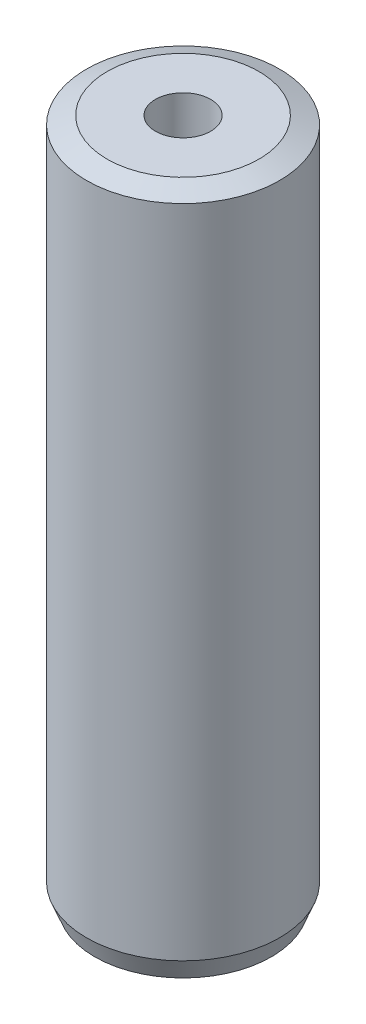
ISO-10303-21;
HEADER;
FILE_DESCRIPTION(('STEP AP214'),'2;1');
FILE_NAME('part.step','',(''),(''),'','','');
FILE_SCHEMA(('AUTOMOTIVE_DESIGN { 1 0 10303 214 1 1 1 1 }'));
ENDSEC;
DATA;
#1=APPLICATION_CONTEXT('core data for automotive mechanical design processes');
#2=APPLICATION_PROTOCOL_DEFINITION('international standard','automotive_design',2000,#1);
#3=PRODUCT_CONTEXT('',#1,'mechanical');
#4=PRODUCT('Part','Part','',(#3));
#5=PRODUCT_RELATED_PRODUCT_CATEGORY('part','',(#4));
#6=PRODUCT_DEFINITION_FORMATION('','',#4);
#7=PRODUCT_DEFINITION_CONTEXT('part definition',#1,'design');
#8=PRODUCT_DEFINITION('design','',#6,#7);
#9=PRODUCT_DEFINITION_SHAPE('','',#8);
#10=(LENGTH_UNIT() NAMED_UNIT(*) SI_UNIT(.MILLI.,.METRE.));
#11=(NAMED_UNIT(*) PLANE_ANGLE_UNIT() SI_UNIT($,.RADIAN.));
#12=(NAMED_UNIT(*) SI_UNIT($,.STERADIAN.) SOLID_ANGLE_UNIT());
#13=UNCERTAINTY_MEASURE_WITH_UNIT(LENGTH_MEASURE(1.E-05),#10,'distance_accuracy_value','');
#14=(GEOMETRIC_REPRESENTATION_CONTEXT(3) GLOBAL_UNCERTAINTY_ASSIGNED_CONTEXT((#13)) GLOBAL_UNIT_ASSIGNED_CONTEXT((#10,
#11,#12)) REPRESENTATION_CONTEXT('',''));
#15=CARTESIAN_POINT('',(0.,0.,0.));
#16=DIRECTION('',(0.,0.,1.));
#17=DIRECTION('',(1.,0.,0.));
#18=AXIS2_PLACEMENT_3D('',#15,#16,#17);
#19=CARTESIAN_POINT('',(0.,159.526723797975,0.));
#20=DIRECTION('',(0.,-1.,0.));
#21=DIRECTION('',(0.,0.,-1.));
#22=AXIS2_PLACEMENT_3D('',#19,#20,#21);
#23=CYLINDRICAL_SURFACE('',#22,22.5);
#24=CARTESIAN_POINT('',(0.,157.619761651747,0.));
#25=DIRECTION('',(0.,1.,0.));
#26=DIRECTION('',(0.,0.,1.));
#27=AXIS2_PLACEMENT_3D('',#24,#25,#26);
#28=CIRCLE('',#27,22.5);
#29=CARTESIAN_POINT('',(0.,157.619761651747,22.5));
#30=VERTEX_POINT('',#29);
#31=EDGE_CURVE('E50',#30,#30,#28,.F.);
#32=ORIENTED_EDGE('',*,*,#31,.T.);
#33=EDGE_LOOP('',(#32));
#34=FACE_BOUND('',#33,.T.);
#35=CARTESIAN_POINT('',(0.,4.80282805095927,0.));
#36=DIRECTION('',(0.,1.,0.));
#37=DIRECTION('',(0.,0.,1.));
#38=AXIS2_PLACEMENT_3D('',#35,#36,#37);
#39=CIRCLE('',#38,22.5);
#40=CARTESIAN_POINT('',(0.,4.80282805095927,22.5));
#41=VERTEX_POINT('',#40);
#42=EDGE_CURVE('E51',#41,#41,#39,.T.);
#43=ORIENTED_EDGE('',*,*,#42,.T.);
#44=EDGE_LOOP('',(#43));
#45=FACE_BOUND('',#44,.T.);
#46=ADVANCED_FACE('F39',(#34,#45),#23,.T.);
#47=CARTESIAN_POINT('',(0.,159.526723797975,0.));
#48=DIRECTION('',(0.,1.,0.));
#49=DIRECTION('',(0.,0.,1.));
#50=AXIS2_PLACEMENT_3D('',#47,#48,#49);
#51=PLANE('',#50);
#52=CARTESIAN_POINT('',(0.,159.526723797975,0.));
#53=DIRECTION('',(0.,1.,0.));
#54=DIRECTION('',(0.,0.,1.));
#55=AXIS2_PLACEMENT_3D('',#52,#53,#54);
#56=CIRCLE('',#55,17.6971719490409);
#57=CARTESIAN_POINT('',(0.,159.526723797975,17.6971719490409));
#58=VERTEX_POINT('',#57);
#59=EDGE_CURVE('E54',#58,#58,#56,.T.);
#60=ORIENTED_EDGE('',*,*,#59,.T.);
#61=EDGE_LOOP('',(#60));
#62=FACE_BOUND('',#61,.T.);
#63=CARTESIAN_POINT('',(0.,159.526723797975,0.));
#64=DIRECTION('',(0.,1.,0.));
#65=DIRECTION('',(0.,0.,1.));
#66=AXIS2_PLACEMENT_3D('',#63,#64,#65);
#67=CIRCLE('',#66,6.44107254682785);
#68=CARTESIAN_POINT('',(0.,159.526723797975,6.44107254682785));
#69=VERTEX_POINT('',#68);
#70=EDGE_CURVE('E58',#69,#69,#67,.T.);
#71=ORIENTED_EDGE('',*,*,#70,.F.);
#72=EDGE_LOOP('',(#71));
#73=FACE_BOUND('',#72,.T.);
#74=ADVANCED_FACE('F69',(#62,#73),#51,.T.);
#75=CARTESIAN_POINT('',(0.,0.,0.));
#76=DIRECTION('',(0.,1.,0.));
#77=DIRECTION('',(0.,0.,1.));
#78=AXIS2_PLACEMENT_3D('',#75,#76,#77);
#79=PLANE('',#78);
#80=CARTESIAN_POINT('',(0.,0.,0.));
#81=DIRECTION('',(0.,1.,0.));
#82=DIRECTION('',(0.,0.,1.));
#83=AXIS2_PLACEMENT_3D('',#80,#81,#82);
#84=CIRCLE('',#83,20.5930378537719);
#85=CARTESIAN_POINT('',(0.,0.,20.5930378537719));
#86=VERTEX_POINT('',#85);
#87=EDGE_CURVE('E10',#86,#86,#84,.F.);
#88=ORIENTED_EDGE('',*,*,#87,.T.);
#89=EDGE_LOOP('',(#88));
#90=FACE_BOUND('',#89,.T.);
#91=CARTESIAN_POINT('',(0.,0.,0.));
#92=DIRECTION('',(0.,1.,0.));
#93=DIRECTION('',(0.,0.,1.));
#94=AXIS2_PLACEMENT_3D('',#91,#92,#93);
#95=CIRCLE('',#94,6.44107254682785);
#96=CARTESIAN_POINT('',(0.,0.,6.44107254682785));
#97=VERTEX_POINT('',#96);
#98=EDGE_CURVE('E63',#97,#97,#95,.T.);
#99=ORIENTED_EDGE('',*,*,#98,.T.);
#100=EDGE_LOOP('',(#99));
#101=FACE_BOUND('',#100,.T.);
#102=ADVANCED_FACE('F75',(#90,#101),#79,.F.);
#103=CARTESIAN_POINT('',(0.,159.526723797975,0.));
#104=DIRECTION('',(0.,-1.,0.));
#105=DIRECTION('',(0.,0.,-1.));
#106=AXIS2_PLACEMENT_3D('',#103,#104,#105);
#107=CYLINDRICAL_SURFACE('',#106,6.44107254682785);
#108=ORIENTED_EDGE('',*,*,#70,.T.);
#109=EDGE_LOOP('',(#108));
#110=FACE_BOUND('',#109,.T.);
#111=ORIENTED_EDGE('',*,*,#98,.F.);
#112=EDGE_LOOP('',(#111));
#113=FACE_BOUND('',#112,.T.);
#114=ADVANCED_FACE('F70',(#110,#113),#107,.F.);
#115=CARTESIAN_POINT('',(0.,159.526723797975,0.));
#116=DIRECTION('',(0.,-1.,0.));
#117=DIRECTION('',(0.,0.,-1.));
#118=AXIS2_PLACEMENT_3D('',#115,#116,#117);
#119=CONICAL_SURFACE('',#118,17.6971719490409,1.19283576876396);
#120=ORIENTED_EDGE('',*,*,#31,.F.);
#121=EDGE_LOOP('',(#120));
#122=FACE_BOUND('',#121,.T.);
#123=ORIENTED_EDGE('',*,*,#59,.F.);
#124=EDGE_LOOP('',(#123));
#125=FACE_BOUND('',#124,.T.);
#126=ADVANCED_FACE('F81',(#122,#125),#119,.T.);
#127=CARTESIAN_POINT('',(0.,4.80282805095927,0.));
#128=DIRECTION('',(0.,1.,0.));
#129=DIRECTION('',(0.,0.,1.));
#130=AXIS2_PLACEMENT_3D('',#127,#128,#129);
#131=CONICAL_SURFACE('',#130,22.5,0.377960558030938);
#132=ORIENTED_EDGE('',*,*,#87,.F.);
#133=EDGE_LOOP('',(#132));
#134=FACE_BOUND('',#133,.T.);
#135=ORIENTED_EDGE('',*,*,#42,.F.);
#136=EDGE_LOOP('',(#135));
#137=FACE_BOUND('',#136,.T.);
#138=ADVANCED_FACE('F45',(#134,#137),#131,.T.);
#139=CLOSED_SHELL('',(#46,#74,#102,#114,#126,#138));
#140=MANIFOLD_SOLID_BREP('B2',#139);
#141=ADVANCED_BREP_SHAPE_REPRESENTATION('',(#18,#140),#14);
#142=SHAPE_DEFINITION_REPRESENTATION(#9,#141);
ENDSEC;
END-ISO-10303-21;
